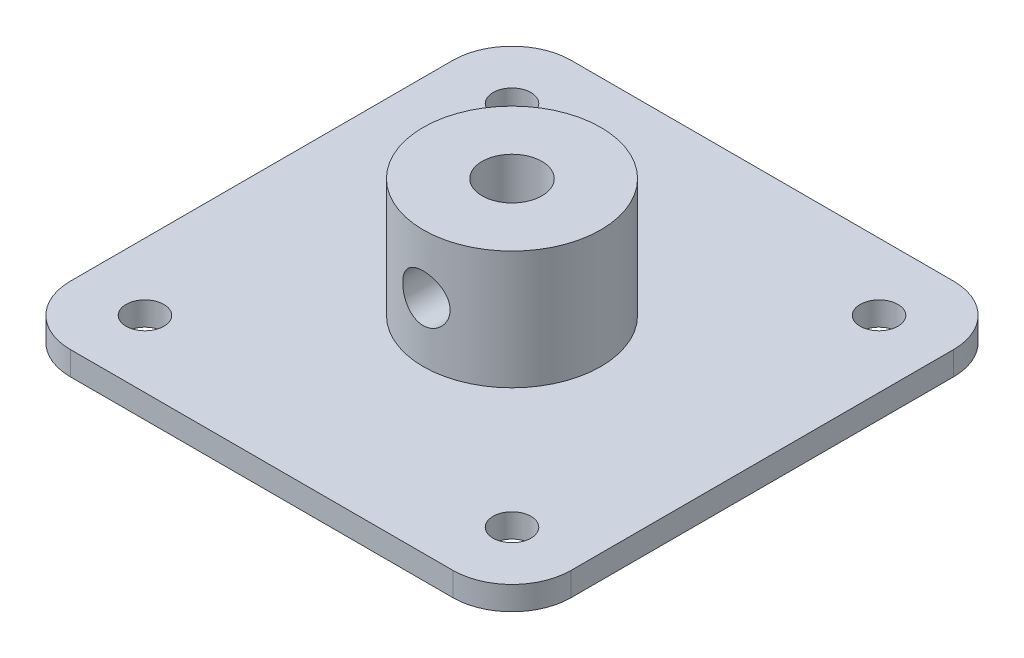
ISO-10303-21;
HEADER;
FILE_DESCRIPTION(('STEP AP214'),'2;1');
FILE_NAME('part.step','',(''),(''),'','','');
FILE_SCHEMA(('AUTOMOTIVE_DESIGN { 1 0 10303 214 1 1 1 1 }'));
ENDSEC;
DATA;
#1=APPLICATION_CONTEXT('core data for automotive mechanical design processes');
#2=APPLICATION_PROTOCOL_DEFINITION('international standard','automotive_design',2000,#1);
#3=PRODUCT_CONTEXT('',#1,'mechanical');
#4=PRODUCT('Part','Part','',(#3));
#5=PRODUCT_RELATED_PRODUCT_CATEGORY('part','',(#4));
#6=PRODUCT_DEFINITION_FORMATION('','',#4);
#7=PRODUCT_DEFINITION_CONTEXT('part definition',#1,'design');
#8=PRODUCT_DEFINITION('design','',#6,#7);
#9=PRODUCT_DEFINITION_SHAPE('','',#8);
#10=(LENGTH_UNIT() NAMED_UNIT(*) SI_UNIT(.MILLI.,.METRE.));
#11=(NAMED_UNIT(*) PLANE_ANGLE_UNIT() SI_UNIT($,.RADIAN.));
#12=(NAMED_UNIT(*) SI_UNIT($,.STERADIAN.) SOLID_ANGLE_UNIT());
#13=UNCERTAINTY_MEASURE_WITH_UNIT(LENGTH_MEASURE(1.E-05),#10,'distance_accuracy_value','');
#14=(GEOMETRIC_REPRESENTATION_CONTEXT(3) GLOBAL_UNCERTAINTY_ASSIGNED_CONTEXT((#13)) GLOBAL_UNIT_ASSIGNED_CONTEXT((#10,
#11,#12)) REPRESENTATION_CONTEXT('',''));
#15=CARTESIAN_POINT('',(0.,0.,0.));
#16=DIRECTION('',(0.,0.,1.));
#17=DIRECTION('',(1.,0.,0.));
#18=AXIS2_PLACEMENT_3D('',#15,#16,#17);
#19=CARTESIAN_POINT('',(21.15,2.,-21.15));
#20=DIRECTION('',(-1.,0.,0.));
#21=DIRECTION('',(0.,0.,1.));
#22=AXIS2_PLACEMENT_3D('',#19,#20,#21);
#23=PLANE('',#22);
#24=DIRECTION('',(0.,0.,-1.));
#25=VECTOR('',#24,1.);
#26=CARTESIAN_POINT('',(21.15,0.,-21.15));
#27=LINE('',#26,#25);
#28=CARTESIAN_POINT('',(21.15,0.,16.15));
#29=VERTEX_POINT('',#28);
#30=CARTESIAN_POINT('',(21.15,0.,-16.15));
#31=VERTEX_POINT('',#30);
#32=EDGE_CURVE('E136',#29,#31,#27,.T.);
#33=ORIENTED_EDGE('',*,*,#32,.T.);
#34=DIRECTION('',(0.,-1.,0.));
#35=VECTOR('',#34,1.);
#36=CARTESIAN_POINT('',(21.15,2.,-16.15));
#37=LINE('',#36,#35);
#38=CARTESIAN_POINT('',(21.15,2.,-16.15));
#39=VERTEX_POINT('',#38);
#40=EDGE_CURVE('E111',#31,#39,#37,.F.);
#41=ORIENTED_EDGE('',*,*,#40,.T.);
#42=DIRECTION('',(0.,0.,-1.));
#43=VECTOR('',#42,1.);
#44=CARTESIAN_POINT('',(21.15,2.,-21.15));
#45=LINE('',#44,#43);
#46=CARTESIAN_POINT('',(21.15,2.,16.15));
#47=VERTEX_POINT('',#46);
#48=EDGE_CURVE('E149',#47,#39,#45,.T.);
#49=ORIENTED_EDGE('',*,*,#48,.F.);
#50=DIRECTION('',(0.,-1.,0.));
#51=VECTOR('',#50,1.);
#52=CARTESIAN_POINT('',(21.15,2.,16.15));
#53=LINE('',#52,#51);
#54=EDGE_CURVE('E117',#47,#29,#53,.T.);
#55=ORIENTED_EDGE('',*,*,#54,.T.);
#56=EDGE_LOOP('',(#33,#41,#49,#55));
#57=FACE_BOUND('',#56,.T.);
#58=ADVANCED_FACE('F39',(#57),#23,.F.);
#59=CARTESIAN_POINT('',(-21.15,2.,-21.15));
#60=DIRECTION('',(0.,0.,1.));
#61=DIRECTION('',(1.,0.,0.));
#62=AXIS2_PLACEMENT_3D('',#59,#60,#61);
#63=PLANE('',#62);
#64=DIRECTION('',(-1.,0.,0.));
#65=VECTOR('',#64,1.);
#66=CARTESIAN_POINT('',(-21.15,2.,-21.15));
#67=LINE('',#66,#65);
#68=CARTESIAN_POINT('',(16.15,2.,-21.15));
#69=VERTEX_POINT('',#68);
#70=CARTESIAN_POINT('',(-16.15,2.,-21.15));
#71=VERTEX_POINT('',#70);
#72=EDGE_CURVE('E127',#69,#71,#67,.T.);
#73=ORIENTED_EDGE('',*,*,#72,.F.);
#74=DIRECTION('',(0.,-1.,0.));
#75=VECTOR('',#74,1.);
#76=CARTESIAN_POINT('',(16.15,2.,-21.15));
#77=LINE('',#76,#75);
#78=CARTESIAN_POINT('',(16.15,0.,-21.15));
#79=VERTEX_POINT('',#78);
#80=EDGE_CURVE('E110',#69,#79,#77,.T.);
#81=ORIENTED_EDGE('',*,*,#80,.T.);
#82=DIRECTION('',(-1.,0.,0.));
#83=VECTOR('',#82,1.);
#84=CARTESIAN_POINT('',(-21.15,0.,-21.15));
#85=LINE('',#84,#83);
#86=CARTESIAN_POINT('',(-16.15,0.,-21.15));
#87=VERTEX_POINT('',#86);
#88=EDGE_CURVE('E124',#79,#87,#85,.T.);
#89=ORIENTED_EDGE('',*,*,#88,.T.);
#90=DIRECTION('',(0.,-1.,0.));
#91=VECTOR('',#90,1.);
#92=CARTESIAN_POINT('',(-16.15,2.,-21.15));
#93=LINE('',#92,#91);
#94=EDGE_CURVE('E130',#87,#71,#93,.F.);
#95=ORIENTED_EDGE('',*,*,#94,.T.);
#96=EDGE_LOOP('',(#73,#81,#89,#95));
#97=FACE_BOUND('',#96,.T.);
#98=ADVANCED_FACE('F123',(#97),#63,.F.);
#99=CARTESIAN_POINT('',(-21.15,2.,-21.15));
#100=DIRECTION('',(1.,0.,0.));
#101=DIRECTION('',(0.,0.,-1.));
#102=AXIS2_PLACEMENT_3D('',#99,#100,#101);
#103=PLANE('',#102);
#104=DIRECTION('',(0.,0.,1.));
#105=VECTOR('',#104,1.);
#106=CARTESIAN_POINT('',(-21.15,0.,-21.15));
#107=LINE('',#106,#105);
#108=CARTESIAN_POINT('',(-21.15,0.,-16.15));
#109=VERTEX_POINT('',#108);
#110=CARTESIAN_POINT('',(-21.15,0.,16.15));
#111=VERTEX_POINT('',#110);
#112=EDGE_CURVE('E135',#109,#111,#107,.T.);
#113=ORIENTED_EDGE('',*,*,#112,.T.);
#114=DIRECTION('',(0.,-1.,0.));
#115=VECTOR('',#114,1.);
#116=CARTESIAN_POINT('',(-21.15,2.,16.15));
#117=LINE('',#116,#115);
#118=CARTESIAN_POINT('',(-21.15,2.,16.15));
#119=VERTEX_POINT('',#118);
#120=EDGE_CURVE('E11',#111,#119,#117,.F.);
#121=ORIENTED_EDGE('',*,*,#120,.T.);
#122=DIRECTION('',(0.,0.,1.));
#123=VECTOR('',#122,1.);
#124=CARTESIAN_POINT('',(-21.15,2.,-21.15));
#125=LINE('',#124,#123);
#126=CARTESIAN_POINT('',(-21.15,2.,-16.15));
#127=VERTEX_POINT('',#126);
#128=EDGE_CURVE('E188',#127,#119,#125,.T.);
#129=ORIENTED_EDGE('',*,*,#128,.F.);
#130=DIRECTION('',(0.,-1.,0.));
#131=VECTOR('',#130,1.);
#132=CARTESIAN_POINT('',(-21.15,2.,-16.15));
#133=LINE('',#132,#131);
#134=EDGE_CURVE('E48',#127,#109,#133,.T.);
#135=ORIENTED_EDGE('',*,*,#134,.T.);
#136=EDGE_LOOP('',(#113,#121,#129,#135));
#137=FACE_BOUND('',#136,.T.);
#138=ADVANCED_FACE('F186',(#137),#103,.F.);
#139=CARTESIAN_POINT('',(-21.15,2.,21.15));
#140=DIRECTION('',(0.,0.,-1.));
#141=DIRECTION('',(-1.,0.,0.));
#142=AXIS2_PLACEMENT_3D('',#139,#140,#141);
#143=PLANE('',#142);
#144=DIRECTION('',(1.,0.,0.));
#145=VECTOR('',#144,1.);
#146=CARTESIAN_POINT('',(-21.15,0.,21.15));
#147=LINE('',#146,#145);
#148=CARTESIAN_POINT('',(-16.15,0.,21.15));
#149=VERTEX_POINT('',#148);
#150=CARTESIAN_POINT('',(16.15,0.,21.15));
#151=VERTEX_POINT('',#150);
#152=EDGE_CURVE('E141',#149,#151,#147,.T.);
#153=ORIENTED_EDGE('',*,*,#152,.T.);
#154=DIRECTION('',(0.,-1.,0.));
#155=VECTOR('',#154,1.);
#156=CARTESIAN_POINT('',(16.15,2.,21.15));
#157=LINE('',#156,#155);
#158=CARTESIAN_POINT('',(16.15,2.,21.15));
#159=VERTEX_POINT('',#158);
#160=EDGE_CURVE('E55',#151,#159,#157,.F.);
#161=ORIENTED_EDGE('',*,*,#160,.T.);
#162=DIRECTION('',(1.,0.,0.));
#163=VECTOR('',#162,1.);
#164=CARTESIAN_POINT('',(-21.15,2.,21.15));
#165=LINE('',#164,#163);
#166=CARTESIAN_POINT('',(-16.15,2.,21.15));
#167=VERTEX_POINT('',#166);
#168=EDGE_CURVE('E151',#167,#159,#165,.T.);
#169=ORIENTED_EDGE('',*,*,#168,.F.);
#170=DIRECTION('',(0.,-1.,0.));
#171=VECTOR('',#170,1.);
#172=CARTESIAN_POINT('',(-16.15,2.,21.15));
#173=LINE('',#172,#171);
#174=EDGE_CURVE('E176',#167,#149,#173,.T.);
#175=ORIENTED_EDGE('',*,*,#174,.T.);
#176=EDGE_LOOP('',(#153,#161,#169,#175));
#177=FACE_BOUND('',#176,.T.);
#178=ADVANCED_FACE('F195',(#177),#143,.F.);
#179=CARTESIAN_POINT('',(0.,2.,0.));
#180=DIRECTION('',(0.,1.,0.));
#181=DIRECTION('',(0.,0.,1.));
#182=AXIS2_PLACEMENT_3D('',#179,#180,#181);
#183=PLANE('',#182);
#184=CARTESIAN_POINT('',(0.,2.,0.));
#185=DIRECTION('',(0.,1.,0.));
#186=DIRECTION('',(0.,0.,1.));
#187=AXIS2_PLACEMENT_3D('',#184,#185,#186);
#188=CIRCLE('',#187,7.5);
#189=CARTESIAN_POINT('',(0.,2.,7.5));
#190=VERTEX_POINT('',#189);
#191=EDGE_CURVE('E238',#190,#190,#188,.T.);
#192=ORIENTED_EDGE('',*,*,#191,.F.);
#193=EDGE_LOOP('',(#192));
#194=FACE_BOUND('',#193,.T.);
#195=CARTESIAN_POINT('',(-15.5,2.,15.5));
#196=DIRECTION('',(0.,1.,0.));
#197=DIRECTION('',(0.,0.,-1.));
#198=AXIS2_PLACEMENT_3D('',#195,#196,#197);
#199=CIRCLE('',#198,1.6);
#200=CARTESIAN_POINT('',(-15.5,2.,13.9));
#201=VERTEX_POINT('',#200);
#202=EDGE_CURVE('E214',#201,#201,#199,.T.);
#203=ORIENTED_EDGE('',*,*,#202,.F.);
#204=EDGE_LOOP('',(#203));
#205=FACE_BOUND('',#204,.T.);
#206=CARTESIAN_POINT('',(15.5,2.,15.5));
#207=DIRECTION('',(0.,1.,0.));
#208=DIRECTION('',(0.,0.,1.));
#209=AXIS2_PLACEMENT_3D('',#206,#207,#208);
#210=CIRCLE('',#209,1.6);
#211=CARTESIAN_POINT('',(15.5,2.,17.1));
#212=VERTEX_POINT('',#211);
#213=EDGE_CURVE('E223',#212,#212,#210,.T.);
#214=ORIENTED_EDGE('',*,*,#213,.F.);
#215=EDGE_LOOP('',(#214));
#216=FACE_BOUND('',#215,.T.);
#217=CARTESIAN_POINT('',(15.5,2.,-15.5));
#218=DIRECTION('',(0.,1.,0.));
#219=DIRECTION('',(0.,0.,-1.));
#220=AXIS2_PLACEMENT_3D('',#217,#218,#219);
#221=CIRCLE('',#220,1.6);
#222=CARTESIAN_POINT('',(15.5,2.,-17.1));
#223=VERTEX_POINT('',#222);
#224=EDGE_CURVE('E231',#223,#223,#221,.T.);
#225=ORIENTED_EDGE('',*,*,#224,.F.);
#226=EDGE_LOOP('',(#225));
#227=FACE_BOUND('',#226,.T.);
#228=CARTESIAN_POINT('',(-15.5,2.,-15.5));
#229=DIRECTION('',(0.,1.,0.));
#230=DIRECTION('',(0.,0.,1.));
#231=AXIS2_PLACEMENT_3D('',#228,#229,#230);
#232=CIRCLE('',#231,1.6);
#233=CARTESIAN_POINT('',(-15.5,2.,-13.9));
#234=VERTEX_POINT('',#233);
#235=EDGE_CURVE('E206',#234,#234,#232,.T.);
#236=ORIENTED_EDGE('',*,*,#235,.F.);
#237=EDGE_LOOP('',(#236));
#238=FACE_BOUND('',#237,.T.);
#239=ORIENTED_EDGE('',*,*,#48,.T.);
#240=CARTESIAN_POINT('',(16.15,2.,-16.15));
#241=DIRECTION('',(0.,1.,0.));
#242=DIRECTION('',(0.,0.,1.));
#243=AXIS2_PLACEMENT_3D('',#240,#241,#242);
#244=CIRCLE('',#243,5.);
#245=EDGE_CURVE('E173',#39,#69,#244,.T.);
#246=ORIENTED_EDGE('',*,*,#245,.T.);
#247=ORIENTED_EDGE('',*,*,#72,.T.);
#248=CARTESIAN_POINT('',(-16.15,2.,-16.15));
#249=DIRECTION('',(0.,1.,0.));
#250=DIRECTION('',(0.,0.,1.));
#251=AXIS2_PLACEMENT_3D('',#248,#249,#250);
#252=CIRCLE('',#251,5.);
#253=EDGE_CURVE('E165',#71,#127,#252,.T.);
#254=ORIENTED_EDGE('',*,*,#253,.T.);
#255=ORIENTED_EDGE('',*,*,#128,.T.);
#256=CARTESIAN_POINT('',(-16.15,2.,16.15));
#257=DIRECTION('',(0.,1.,0.));
#258=DIRECTION('',(0.,0.,1.));
#259=AXIS2_PLACEMENT_3D('',#256,#257,#258);
#260=CIRCLE('',#259,5.);
#261=EDGE_CURVE('E62',#119,#167,#260,.T.);
#262=ORIENTED_EDGE('',*,*,#261,.T.);
#263=ORIENTED_EDGE('',*,*,#168,.T.);
#264=CARTESIAN_POINT('',(16.15,2.,16.15));
#265=DIRECTION('',(0.,1.,0.));
#266=DIRECTION('',(0.,0.,1.));
#267=AXIS2_PLACEMENT_3D('',#264,#265,#266);
#268=CIRCLE('',#267,5.);
#269=EDGE_CURVE('E170',#159,#47,#268,.T.);
#270=ORIENTED_EDGE('',*,*,#269,.T.);
#271=EDGE_LOOP('',(#239,#246,#247,#254,#255,#262,#263,#270));
#272=FACE_BOUND('',#271,.T.);
#273=ADVANCED_FACE('F299',(#194,#205,#216,#227,#238,#272),#183,.T.);
#274=CARTESIAN_POINT('',(0.,0.,0.));
#275=DIRECTION('',(0.,1.,0.));
#276=DIRECTION('',(0.,0.,1.));
#277=AXIS2_PLACEMENT_3D('',#274,#275,#276);
#278=PLANE('',#277);
#279=CARTESIAN_POINT('',(0.,0.,0.));
#280=DIRECTION('',(0.,1.,0.));
#281=DIRECTION('',(0.,0.,1.));
#282=AXIS2_PLACEMENT_3D('',#279,#280,#281);
#283=CIRCLE('',#282,2.525);
#284=CARTESIAN_POINT('',(0.,0.,2.525));
#285=VERTEX_POINT('',#284);
#286=EDGE_CURVE('E242',#285,#285,#283,.T.);
#287=ORIENTED_EDGE('',*,*,#286,.T.);
#288=EDGE_LOOP('',(#287));
#289=FACE_BOUND('',#288,.T.);
#290=CARTESIAN_POINT('',(-15.5,0.,15.5));
#291=DIRECTION('',(0.,1.,0.));
#292=DIRECTION('',(0.,0.,-1.));
#293=AXIS2_PLACEMENT_3D('',#290,#291,#292);
#294=CIRCLE('',#293,1.6);
#295=CARTESIAN_POINT('',(-15.5,0.,13.9));
#296=VERTEX_POINT('',#295);
#297=EDGE_CURVE('E218',#296,#296,#294,.T.);
#298=ORIENTED_EDGE('',*,*,#297,.T.);
#299=EDGE_LOOP('',(#298));
#300=FACE_BOUND('',#299,.T.);
#301=CARTESIAN_POINT('',(15.5,0.,15.5));
#302=DIRECTION('',(0.,1.,0.));
#303=DIRECTION('',(0.,0.,1.));
#304=AXIS2_PLACEMENT_3D('',#301,#302,#303);
#305=CIRCLE('',#304,1.6);
#306=CARTESIAN_POINT('',(15.5,0.,17.1));
#307=VERTEX_POINT('',#306);
#308=EDGE_CURVE('E227',#307,#307,#305,.T.);
#309=ORIENTED_EDGE('',*,*,#308,.T.);
#310=EDGE_LOOP('',(#309));
#311=FACE_BOUND('',#310,.T.);
#312=CARTESIAN_POINT('',(15.5,0.,-15.5));
#313=DIRECTION('',(0.,1.,0.));
#314=DIRECTION('',(0.,0.,-1.));
#315=AXIS2_PLACEMENT_3D('',#312,#313,#314);
#316=CIRCLE('',#315,1.6);
#317=CARTESIAN_POINT('',(15.5,0.,-17.1));
#318=VERTEX_POINT('',#317);
#319=EDGE_CURVE('E210',#318,#318,#316,.T.);
#320=ORIENTED_EDGE('',*,*,#319,.T.);
#321=EDGE_LOOP('',(#320));
#322=FACE_BOUND('',#321,.T.);
#323=CARTESIAN_POINT('',(-15.5,0.,-15.5));
#324=DIRECTION('',(0.,1.,0.));
#325=DIRECTION('',(0.,0.,1.));
#326=AXIS2_PLACEMENT_3D('',#323,#324,#325);
#327=CIRCLE('',#326,1.6);
#328=CARTESIAN_POINT('',(-15.5,0.,-13.9));
#329=VERTEX_POINT('',#328);
#330=EDGE_CURVE('E143',#329,#329,#327,.T.);
#331=ORIENTED_EDGE('',*,*,#330,.T.);
#332=EDGE_LOOP('',(#331));
#333=FACE_BOUND('',#332,.T.);
#334=ORIENTED_EDGE('',*,*,#88,.F.);
#335=CARTESIAN_POINT('',(16.15,0.,-16.15));
#336=DIRECTION('',(0.,1.,0.));
#337=DIRECTION('',(0.,0.,1.));
#338=AXIS2_PLACEMENT_3D('',#335,#336,#337);
#339=CIRCLE('',#338,5.);
#340=EDGE_CURVE('E106',#79,#31,#339,.F.);
#341=ORIENTED_EDGE('',*,*,#340,.T.);
#342=ORIENTED_EDGE('',*,*,#32,.F.);
#343=CARTESIAN_POINT('',(16.15,0.,16.15));
#344=DIRECTION('',(0.,1.,0.));
#345=DIRECTION('',(0.,0.,1.));
#346=AXIS2_PLACEMENT_3D('',#343,#344,#345);
#347=CIRCLE('',#346,5.);
#348=EDGE_CURVE('E118',#29,#151,#347,.F.);
#349=ORIENTED_EDGE('',*,*,#348,.T.);
#350=ORIENTED_EDGE('',*,*,#152,.F.);
#351=CARTESIAN_POINT('',(-16.15,0.,16.15));
#352=DIRECTION('',(0.,1.,0.));
#353=DIRECTION('',(0.,0.,1.));
#354=AXIS2_PLACEMENT_3D('',#351,#352,#353);
#355=CIRCLE('',#354,5.);
#356=EDGE_CURVE('E155',#149,#111,#355,.F.);
#357=ORIENTED_EDGE('',*,*,#356,.T.);
#358=ORIENTED_EDGE('',*,*,#112,.F.);
#359=CARTESIAN_POINT('',(-16.15,0.,-16.15));
#360=DIRECTION('',(0.,1.,0.));
#361=DIRECTION('',(0.,0.,1.));
#362=AXIS2_PLACEMENT_3D('',#359,#360,#361);
#363=CIRCLE('',#362,5.);
#364=EDGE_CURVE('E129',#109,#87,#363,.F.);
#365=ORIENTED_EDGE('',*,*,#364,.T.);
#366=EDGE_LOOP('',(#334,#341,#342,#349,#350,#357,#358,#365));
#367=FACE_BOUND('',#366,.T.);
#368=ADVANCED_FACE('F132',(#289,#300,#311,#322,#333,#367),#278,.F.);
#369=CARTESIAN_POINT('',(-15.5,0.,-15.5));
#370=DIRECTION('',(0.,1.,0.));
#371=DIRECTION('',(0.,0.,1.));
#372=AXIS2_PLACEMENT_3D('',#369,#370,#371);
#373=CYLINDRICAL_SURFACE('',#372,1.6);
#374=ORIENTED_EDGE('',*,*,#330,.F.);
#375=EDGE_LOOP('',(#374));
#376=FACE_BOUND('',#375,.T.);
#377=ORIENTED_EDGE('',*,*,#235,.T.);
#378=EDGE_LOOP('',(#377));
#379=FACE_BOUND('',#378,.T.);
#380=ADVANCED_FACE('F288',(#376,#379),#373,.F.);
#381=CARTESIAN_POINT('',(15.5,0.,-15.5));
#382=DIRECTION('',(0.,1.,0.));
#383=DIRECTION('',(0.,0.,1.));
#384=AXIS2_PLACEMENT_3D('',#381,#382,#383);
#385=CYLINDRICAL_SURFACE('',#384,1.6);
#386=ORIENTED_EDGE('',*,*,#319,.F.);
#387=EDGE_LOOP('',(#386));
#388=FACE_BOUND('',#387,.T.);
#389=ORIENTED_EDGE('',*,*,#224,.T.);
#390=EDGE_LOOP('',(#389));
#391=FACE_BOUND('',#390,.T.);
#392=ADVANCED_FACE('F284',(#388,#391),#385,.F.);
#393=CARTESIAN_POINT('',(15.5,0.,15.5));
#394=DIRECTION('',(0.,1.,0.));
#395=DIRECTION('',(0.,0.,1.));
#396=AXIS2_PLACEMENT_3D('',#393,#394,#395);
#397=CYLINDRICAL_SURFACE('',#396,1.6);
#398=ORIENTED_EDGE('',*,*,#308,.F.);
#399=EDGE_LOOP('',(#398));
#400=FACE_BOUND('',#399,.T.);
#401=ORIENTED_EDGE('',*,*,#213,.T.);
#402=EDGE_LOOP('',(#401));
#403=FACE_BOUND('',#402,.T.);
#404=ADVANCED_FACE('F287',(#400,#403),#397,.F.);
#405=CARTESIAN_POINT('',(-15.5,0.,15.5));
#406=DIRECTION('',(0.,1.,0.));
#407=DIRECTION('',(0.,0.,1.));
#408=AXIS2_PLACEMENT_3D('',#405,#406,#407);
#409=CYLINDRICAL_SURFACE('',#408,1.6);
#410=ORIENTED_EDGE('',*,*,#297,.F.);
#411=EDGE_LOOP('',(#410));
#412=FACE_BOUND('',#411,.T.);
#413=ORIENTED_EDGE('',*,*,#202,.T.);
#414=EDGE_LOOP('',(#413));
#415=FACE_BOUND('',#414,.T.);
#416=ADVANCED_FACE('F282',(#412,#415),#409,.F.);
#417=CARTESIAN_POINT('',(0.,12.,0.));
#418=DIRECTION('',(0.,-1.,0.));
#419=DIRECTION('',(0.,0.,-1.));
#420=AXIS2_PLACEMENT_3D('',#417,#418,#419);
#421=CYLINDRICAL_SURFACE('',#420,7.5);
#422=CARTESIAN_POINT('',(2.,7.,7.22841614740048));
#423=CARTESIAN_POINT('',(1.99999734315871,7.11017593774028,7.22841805697252));
#424=CARTESIAN_POINT('',(1.99086493224743,7.22038000047602,7.23096264549673));
#425=CARTESIAN_POINT('',(1.95464583260237,7.43760542155637,7.24083561155097));
#426=CARTESIAN_POINT('',(1.92755013620953,7.54462515497806,7.24816638907934));
#427=CARTESIAN_POINT('',(1.85635845560073,7.75230806994678,7.26672375176839));
#428=CARTESIAN_POINT('',(1.81228637542178,7.85297995882843,7.27794485684204));
#429=CARTESIAN_POINT('',(1.70846784563703,8.04551674005983,7.30301154920402));
#430=CARTESIAN_POINT('',(1.64872017841449,8.13738094750699,7.31685734034424));
#431=CARTESIAN_POINT('',(1.51364847874559,8.31199254698772,7.34600139553467));
#432=CARTESIAN_POINT('',(1.43800297504208,8.39448701746446,7.36132541116443));
#433=CARTESIAN_POINT('',(1.27397427284021,8.5457815769512,7.39147701436507));
#434=CARTESIAN_POINT('',(1.18558975534664,8.61458024614179,7.40630455033439));
#435=CARTESIAN_POINT('',(0.99683817087327,8.73758493840293,7.43407988468418));
#436=CARTESIAN_POINT('',(0.89630181987948,8.79153951863285,7.44699376262293));
#437=CARTESIAN_POINT('',(0.687183044729091,8.88168463536726,7.46919126211834));
#438=CARTESIAN_POINT('',(0.578601980875103,8.91787816728156,7.47847549576262));
#439=CARTESIAN_POINT('',(0.35911596181009,8.97065522023577,7.49218553576461));
#440=CARTESIAN_POINT('',(0.248321224200916,8.98766897662592,7.49671776750265));
#441=CARTESIAN_POINT('',(0.0253635535085755,9.00295712010718,7.50078524617749));
#442=CARTESIAN_POINT('',(-0.0867991474385297,9.00123464363014,7.50032132946608));
#443=CARTESIAN_POINT('',(-0.306314237111346,8.97940218746053,7.49452675859765));
#444=CARTESIAN_POINT('',(-0.41371660072111,8.95975704236371,7.48931914026999));
#445=CARTESIAN_POINT('',(-0.623641315571055,8.90338786221805,7.4747674859047));
#446=CARTESIAN_POINT('',(-0.726163388180581,8.86666285331395,7.46542321400589));
#447=CARTESIAN_POINT('',(-0.924603945147554,8.77682015240762,7.44346569099892));
#448=CARTESIAN_POINT('',(-1.02044668632954,8.7235431928993,7.43082087877672));
#449=CARTESIAN_POINT('',(-1.20198999876452,8.6022311804909,7.40362468509504));
#450=CARTESIAN_POINT('',(-1.28768858808586,8.53419325097182,7.38907293223));
#451=CARTESIAN_POINT('',(-1.44928536946561,8.38282314206609,7.35911272938719));
#452=CARTESIAN_POINT('',(-1.52480192017774,8.29908555495064,7.34369169368738));
#453=CARTESIAN_POINT('',(-1.6608133210477,8.11997532376118,7.31413405023521));
#454=CARTESIAN_POINT('',(-1.72130725529808,8.02460197079955,7.29999752083065));
#455=CARTESIAN_POINT('',(-1.82584679186274,7.82409989817869,7.27455902280777));
#456=CARTESIAN_POINT('',(-1.86978866600526,7.71891464908684,7.26327507092156));
#457=CARTESIAN_POINT('',(-1.93924001685674,7.50227350054503,7.24504325087515));
#458=CARTESIAN_POINT('',(-1.96475406461341,7.39081916354967,7.23809430746845));
#459=CARTESIAN_POINT('',(-1.99596757092855,7.16837278897164,7.22954835612976));
#460=CARTESIAN_POINT('',(-2.00223632621177,7.05746645137869,7.22779763213457));
#461=CARTESIAN_POINT('',(-1.9963498112297,6.83619022719145,7.22942578390815));
#462=CARTESIAN_POINT('',(-1.98419650172323,6.72582028476005,7.23280411376438));
#463=CARTESIAN_POINT('',(-1.94231271869971,6.51094340590845,7.24416124318865));
#464=CARTESIAN_POINT('',(-1.91292447912922,6.40636456206277,7.25205039699299));
#465=CARTESIAN_POINT('',(-1.83778986725474,6.20362036864007,7.27145268952784));
#466=CARTESIAN_POINT('',(-1.79204135876651,6.10545585857257,7.28296630148563));
#467=CARTESIAN_POINT('',(-1.68432905508707,5.91594504256479,7.30863572472984));
#468=CARTESIAN_POINT('',(-1.62203095237924,5.82479602411027,7.32284404872864));
#469=CARTESIAN_POINT('',(-1.48340227987515,5.65403669829684,7.35217841933666));
#470=CARTESIAN_POINT('',(-1.40706907222966,5.57442856504585,7.36730463810238));
#471=CARTESIAN_POINT('',(-1.23990378250484,5.42664752675008,7.39729964884456));
#472=CARTESIAN_POINT('',(-1.14871641600885,5.35887162302142,7.41214836523849));
#473=CARTESIAN_POINT('',(-0.955928435940742,5.23958901258948,7.43946670017127));
#474=CARTESIAN_POINT('',(-0.854328377018883,5.18808143992108,7.45193644532905));
#475=CARTESIAN_POINT('',(-0.644314134825872,5.10327036763849,7.47301150899261));
#476=CARTESIAN_POINT('',(-0.535957852882338,5.06983098055653,7.48164558480385));
#477=CARTESIAN_POINT('',(-0.314899384731321,5.02171127193564,7.49420303787247));
#478=CARTESIAN_POINT('',(-0.202198167320244,5.00702679322532,7.4981274590498));
#479=CARTESIAN_POINT('',(0.0206420013461487,4.99709417625856,7.50077413437691));
#480=CARTESIAN_POINT('',(0.130753511527863,5.00126368086883,7.49965226288082));
#481=CARTESIAN_POINT('',(0.348648304630717,5.02756849357521,7.4926849097886));
#482=CARTESIAN_POINT('',(0.456431674812814,5.04970312711705,7.48683960554786));
#483=CARTESIAN_POINT('',(0.66591012346421,5.1109806049186,7.47111310390923));
#484=CARTESIAN_POINT('',(0.76764201185154,5.15000529347244,7.46125997189229));
#485=CARTESIAN_POINT('',(0.963172098471353,5.24384960174624,7.43854816516494));
#486=CARTESIAN_POINT('',(1.05696918166215,5.29867143661281,7.42568906899253));
#487=CARTESIAN_POINT('',(1.23667826867367,5.42425827213702,7.39791331224121));
#488=CARTESIAN_POINT('',(1.32231336173331,5.49540938069866,7.38295093371635));
#489=CARTESIAN_POINT('',(1.48062537156133,5.65090274936491,7.35284000077256));
#490=CARTESIAN_POINT('',(1.55329887243048,5.73524847581935,7.33769139839721));
#491=CARTESIAN_POINT('',(1.68520700232562,5.9169683958176,7.30853959638856));
#492=CARTESIAN_POINT('',(1.74411094261233,6.01458831365721,7.29456891224646));
#493=CARTESIAN_POINT('',(1.84458689030054,6.21870631086024,7.26981393903472));
#494=CARTESIAN_POINT('',(1.88617023367332,6.32519852853948,7.25902756724947));
#495=CARTESIAN_POINT('',(1.94538124252481,6.52608133605125,7.24336000653874));
#496=CARTESIAN_POINT('',(1.96581518399489,6.61960126455672,7.23780140272195));
#497=CARTESIAN_POINT('',(1.9931249429388,6.80874055799397,7.2303288521157));
#498=CARTESIAN_POINT('',(2.0000023063216,6.90435968228881,7.22841448976016));
#499=CARTESIAN_POINT('',(2.,7.,7.22841614740048));
#500=B_SPLINE_CURVE_WITH_KNOTS('',3,(#422,#423,#424,#425,#426,#427,#428,#429,#430,#431,#432,
#433,#434,#435,#436,#437,#438,#439,#440,#441,#442,#443,#444,#445,#446,#447,#448,#449,#450,#451,
#452,#453,#454,#455,#456,#457,#458,#459,#460,#461,#462,#463,#464,#465,#466,#467,#468,#469,#470,
#471,#472,#473,#474,#475,#476,#477,#478,#479,#480,#481,#482,#483,#484,#485,#486,#487,#488,#489,
#490,#491,#492,#493,#494,#495,#496,#497,#498,#499),.UNSPECIFIED.,.T.,.F.,(4,2,2,2,2,2,2,2,2,2,2,
2,2,2,2,2,2,2,2,2,2,2,2,2,2,2,2,2,2,2,2,2,2,2,2,2,2,2,4),(0.,0.330176128116026,
0.660517947850201,0.990396311596169,1.32030030656105,1.65765916130211,1.99505297124461,
2.33785207370803,2.68059334304246,3.0154830431648,3.35031668385603,3.67670570800803,
4.00311334440695,4.3327644890557,4.66247993394491,5.00231762300329,5.34217602639579,
5.68413015096536,6.02599942418508,6.35765334242023,6.68927196343503,7.01451850432574,
7.33980752864823,7.67224634967772,8.00474771541474,8.34685906959633,8.68895221008103,
9.028435395914,9.36784331959005,9.69684054916462,10.0258254261296,10.3525451486866,
10.6793107076596,11.0147885399158,11.3503546538105,11.6933003898558,12.0360213210131,
12.3226696767153,12.6092853429065),.UNSPECIFIED.);
#501=CARTESIAN_POINT('',(2.,7.,7.22841614740048));
#502=VERTEX_POINT('',#501);
#503=EDGE_CURVE('E250',#502,#502,#500,.T.);
#504=ORIENTED_EDGE('',*,*,#503,.F.);
#505=EDGE_LOOP('',(#504));
#506=FACE_BOUND('',#505,.T.);
#507=CARTESIAN_POINT('',(0.,12.,0.));
#508=DIRECTION('',(0.,1.,0.));
#509=DIRECTION('',(0.,0.,1.));
#510=AXIS2_PLACEMENT_3D('',#507,#508,#509);
#511=CIRCLE('',#510,7.5);
#512=CARTESIAN_POINT('',(0.,12.,7.5));
#513=VERTEX_POINT('',#512);
#514=EDGE_CURVE('E219',#513,#513,#511,.T.);
#515=ORIENTED_EDGE('',*,*,#514,.F.);
#516=EDGE_LOOP('',(#515));
#517=FACE_BOUND('',#516,.T.);
#518=ORIENTED_EDGE('',*,*,#191,.T.);
#519=EDGE_LOOP('',(#518));
#520=FACE_BOUND('',#519,.T.);
#521=ADVANCED_FACE('F278',(#506,#517,#520),#421,.T.);
#522=CARTESIAN_POINT('',(0.,12.,0.));
#523=DIRECTION('',(0.,1.,0.));
#524=DIRECTION('',(0.,0.,1.));
#525=AXIS2_PLACEMENT_3D('',#522,#523,#524);
#526=PLANE('',#525);
#527=CARTESIAN_POINT('',(0.,12.,0.));
#528=DIRECTION('',(0.,1.,0.));
#529=DIRECTION('',(0.,0.,1.));
#530=AXIS2_PLACEMENT_3D('',#527,#528,#529);
#531=CIRCLE('',#530,2.525);
#532=CARTESIAN_POINT('',(0.,12.,2.525));
#533=VERTEX_POINT('',#532);
#534=EDGE_CURVE('E246',#533,#533,#531,.T.);
#535=ORIENTED_EDGE('',*,*,#534,.F.);
#536=EDGE_LOOP('',(#535));
#537=FACE_BOUND('',#536,.T.);
#538=ORIENTED_EDGE('',*,*,#514,.T.);
#539=EDGE_LOOP('',(#538));
#540=FACE_BOUND('',#539,.T.);
#541=ADVANCED_FACE('F274',(#537,#540),#526,.T.);
#542=CARTESIAN_POINT('',(0.,0.,0.));
#543=DIRECTION('',(0.,1.,0.));
#544=DIRECTION('',(0.,0.,1.));
#545=AXIS2_PLACEMENT_3D('',#542,#543,#544);
#546=CYLINDRICAL_SURFACE('',#545,2.525);
#547=CARTESIAN_POINT('',(2.,7.,1.54130626417984));
#548=CARTESIAN_POINT('',(2.00000317478852,6.92381301140877,1.54129889289935));
#549=CARTESIAN_POINT('',(1.99560881027239,6.84764065614834,1.54705302146927));
#550=CARTESIAN_POINT('',(1.97846742854705,6.69769668206914,1.56890878907999));
#551=CARTESIAN_POINT('',(1.96570220531862,6.62393066479991,1.58503298079249));
#552=CARTESIAN_POINT('',(1.92710662339401,6.45591917801637,1.63189193090131));
#553=CARTESIAN_POINT('',(1.89830778589067,6.36325156747414,1.66573198115219));
#554=CARTESIAN_POINT('',(1.82922507719416,6.18571466927005,1.74131935345498));
#555=CARTESIAN_POINT('',(1.78890758455166,6.10086918662662,1.78308970148616));
#556=CARTESIAN_POINT('',(1.6821388550536,5.91094871943806,1.88498869899315));
#557=CARTESIAN_POINT('',(1.61146938520318,5.8089730332497,1.94648477363496));
#558=CARTESIAN_POINT('',(1.45220699437782,5.61927909816718,2.06803723974961));
#559=CARTESIAN_POINT('',(1.36362888842967,5.53154917185188,2.12809477562756));
#560=CARTESIAN_POINT('',(1.1878267096983,5.38775675246354,2.23000634879869));
#561=CARTESIAN_POINT('',(1.10367293256742,5.32885252718822,2.27313165482082));
#562=CARTESIAN_POINT('',(0.924631714084026,5.22354245444415,2.3516364875072));
#563=CARTESIAN_POINT('',(0.8297611318899,5.17711735382898,2.38702793022871));
#564=CARTESIAN_POINT('',(0.646739501143734,5.10532505718287,2.44233197000764));
#565=CARTESIAN_POINT('',(0.559920496163954,5.07778278390706,2.46381133709417));
#566=CARTESIAN_POINT('',(0.38163911590209,5.0346131319654,2.49763658839044));
#567=CARTESIAN_POINT('',(0.290179267866218,5.01897934106259,2.50998738785879));
#568=CARTESIAN_POINT('',(0.104846578862318,5.00057411986345,2.52453887057928));
#569=CARTESIAN_POINT('',(0.0109667899837609,4.99784516975851,2.52670603115285));
#570=CARTESIAN_POINT('',(-0.175904797642351,5.00555684522321,2.52059973073326));
#571=CARTESIAN_POINT('',(-0.268896538522949,5.01599832318316,2.51232559397913));
#572=CARTESIAN_POINT('',(-0.446422857028333,5.04847886495483,2.4867582529663));
#573=CARTESIAN_POINT('',(-0.531146128904647,5.06989059565377,2.46995331716056));
#574=CARTESIAN_POINT('',(-0.695420680761349,5.12280932881192,2.42882549652588));
#575=CARTESIAN_POINT('',(-0.774970672240586,5.15431883481239,2.40450074736265));
#576=CARTESIAN_POINT('',(-0.935225614309432,5.22970294250884,2.34710874615225));
#577=CARTESIAN_POINT('',(-1.01527357156992,5.2744893442661,2.31341665029539));
#578=CARTESIAN_POINT('',(-1.16688946237917,5.37317348485261,2.24077532061343));
#579=CARTESIAN_POINT('',(-1.23845223598291,5.42707671989193,2.20182291841145));
#580=CARTESIAN_POINT('',(-1.3865469927922,5.55469316135635,2.11235549514404));
#581=CARTESIAN_POINT('',(-1.46108672754716,5.63020179754603,2.06110774743181));
#582=CARTESIAN_POINT('',(-1.59718512048189,5.7916257213492,1.9575329792418));
#583=CARTESIAN_POINT('',(-1.65872918073348,5.87755254292375,1.90520481678606));
#584=CARTESIAN_POINT('',(-1.76186016543743,6.04887050539829,1.80991903408609));
#585=CARTESIAN_POINT('',(-1.80493906386817,6.13314994792387,1.76658110499705));
#586=CARTESIAN_POINT('',(-1.87955915643418,6.30977811789666,1.68696387131072));
#587=CARTESIAN_POINT('',(-1.91112568491175,6.40210856606086,1.65066915072983));
#588=CARTESIAN_POINT('',(-1.95387797995322,6.56709142904491,1.59961642405609));
#589=CARTESIAN_POINT('',(-1.96830549321608,6.63789019914126,1.58166951379016));
#590=CARTESIAN_POINT('',(-1.98944540749103,6.78227543149995,1.55500193322927));
#591=CARTESIAN_POINT('',(-1.99617395542132,6.8558557238362,1.54626195644663));
#592=CARTESIAN_POINT('',(-2.00137682346259,7.00418775155028,1.53952608451401));
#593=CARTESIAN_POINT('',(-1.99981109398124,7.0789434298179,1.54158231932555));
#594=CARTESIAN_POINT('',(-1.98848485726517,7.22682684534581,1.55615804660381));
#595=CARTESIAN_POINT('',(-1.97871223978666,7.29995201280428,1.56869300154954));
#596=CARTESIAN_POINT('',(-1.94801681011135,7.46241471520758,1.60673241817709));
#597=CARTESIAN_POINT('',(-1.92476585787718,7.55067685532522,1.63485647514801));
#598=CARTESIAN_POINT('',(-1.867865861402,7.7205213516915,1.6995767059675));
#599=CARTESIAN_POINT('',(-1.83418651101317,7.80208335085592,1.73619749352755));
#600=CARTESIAN_POINT('',(-1.74121976762073,7.99175284490502,1.83024153250884));
#601=CARTESIAN_POINT('',(-1.67713264574749,8.09640499249639,1.88988998305205));
#602=CARTESIAN_POINT('',(-1.53136821430703,8.29221851406587,2.00985646809369));
#603=CARTESIAN_POINT('',(-1.44967239649368,8.38336552157125,2.07017514329597));
#604=CARTESIAN_POINT('',(-1.26791093476352,8.55172241122086,2.18626012766138));
#605=CARTESIAN_POINT('',(-1.16766424373143,8.62877859241228,2.24197297278575));
#606=CARTESIAN_POINT('',(-1.00499336296678,8.73033732677895,2.31715106186275));
#607=CARTESIAN_POINT('',(-0.948770647041221,8.76183258485293,2.34079595975809));
#608=CARTESIAN_POINT('',(-0.832478518308719,8.81966869431026,2.38463009677325));
#609=CARTESIAN_POINT('',(-0.77241133892908,8.84601250297416,2.4048213176983));
#610=CARTESIAN_POINT('',(-0.627118081077583,8.90123296416258,2.44742763651519));
#611=CARTESIAN_POINT('',(-0.540462423362046,8.92775225645717,2.46813513398132));
#612=CARTESIAN_POINT('',(-0.362773927164141,8.96893404188004,2.50043247737561));
#613=CARTESIAN_POINT('',(-0.271744431463428,8.98360544192841,2.51202917237662));
#614=CARTESIAN_POINT('',(-0.0874969403063761,9.00023010692016,2.52517696544923));
#615=CARTESIAN_POINT('',(0.00572699943720737,9.00214353039641,2.52669659409995));
#616=CARTESIAN_POINT('',(0.191134396672803,8.99300923159818,2.51946487694757));
#617=CARTESIAN_POINT('',(0.283317710338857,8.98195973932364,2.51071212851955));
#618=CARTESIAN_POINT('',(0.45987412293386,8.94839412115929,2.48430349606139));
#619=CARTESIAN_POINT('',(0.544412315251133,8.92640731108267,2.46705893326437));
#620=CARTESIAN_POINT('',(0.708231126508918,8.87239308007573,2.42511690292539));
#621=CARTESIAN_POINT('',(0.787510406247684,8.84036311341995,2.40041754581195));
#622=CARTESIAN_POINT('',(0.94743451232798,8.76380688213511,2.34221199706521));
#623=CARTESIAN_POINT('',(1.02738975112045,8.71833760825955,2.30806345270942));
#624=CARTESIAN_POINT('',(1.17872701852194,8.61828475787361,2.23457331621269));
#625=CARTESIAN_POINT('',(1.25010344594912,8.56369528168913,2.19522836609556));
#626=CARTESIAN_POINT('',(1.39780209662018,8.4344604097667,2.10492934630481));
#627=CARTESIAN_POINT('',(1.47209645832321,8.35800184697025,2.05325679546943));
#628=CARTESIAN_POINT('',(1.60753884098496,8.19461376388492,1.94903584846874));
#629=CARTESIAN_POINT('',(1.66867439293031,8.10767443285094,1.8964866719826));
#630=CARTESIAN_POINT('',(1.76987914243831,7.93598822827504,1.80201980426968));
#631=CARTESIAN_POINT('',(1.81167749455661,7.85252701192299,1.75962409890049));
#632=CARTESIAN_POINT('',(1.88403404633436,7.67773972403067,1.68191861154209));
#633=CARTESIAN_POINT('',(1.91461010162235,7.58642643409615,1.64659761413285));
#634=CARTESIAN_POINT('',(1.95851543200126,7.41317617132319,1.59399415823379));
#635=CARTESIAN_POINT('',(1.97393760459828,7.33243369646496,1.57462705810807));
#636=CARTESIAN_POINT('',(1.99466233376339,7.16778107547707,1.54830655728858));
#637=CARTESIAN_POINT('',(1.99999650456642,7.08388166851297,1.54131437993973));
#638=CARTESIAN_POINT('',(2.,7.,1.54130626417984));
#639=B_SPLINE_CURVE_WITH_KNOTS('',3,(#547,#548,#549,#550,#551,#552,#553,#554,#555,#556,#557,
#558,#559,#560,#561,#562,#563,#564,#565,#566,#567,#568,#569,#570,#571,#572,#573,#574,#575,#576,
#577,#578,#579,#580,#581,#582,#583,#584,#585,#586,#587,#588,#589,#590,#591,#592,#593,#594,#595,
#596,#597,#598,#599,#600,#601,#602,#603,#604,#605,#606,#607,#608,#609,#610,#611,#612,#613,#614,
#615,#616,#617,#618,#619,#620,#621,#622,#623,#624,#625,#626,#627,#628,#629,#630,#631,#632,#633,
#634,#635,#636,#637,#638),.UNSPECIFIED.,.T.,.F.,(4,2,2,2,2,2,2,2,2,2,2,2,2,2,2,2,2,2,2,2,2,2,2,
2,2,2,2,2,2,2,2,2,2,2,2,2,2,2,2,2,2,2,2,2,2,4),(0.,0.228227527357189,0.456953086976423,
0.763549413244423,1.07104996082069,1.48447542687956,1.89756027343416,2.23051601339228,
2.56295507236225,2.84250760524556,3.12190950375954,3.40223050097981,3.68256964151059,
3.94841902989234,4.2143343813677,4.50642302290975,4.79868838595137,5.15091023312368,
5.50352564774282,5.81491893164811,6.12562276258562,6.34813222598359,6.57017416347336,
6.79328922283061,7.01673409480657,7.30166077627914,7.58742338538664,7.99466880625878,
8.40234438267481,8.81423135733826,9.01983843684451,9.22532713521449,9.50295272819799,
9.78036941507833,10.0586520333232,10.3369726536342,10.6029712868876,10.869037399688,
11.1623149518842,11.4557829592122,11.809918062112,12.1643872729468,12.4710503097382,
12.7772232823934,13.0292924363148,13.2805703270584),.UNSPECIFIED.);
#640=CARTESIAN_POINT('',(2.,7.,1.54130626417984));
#641=VERTEX_POINT('',#640);
#642=EDGE_CURVE('E262',#641,#641,#639,.T.);
#643=ORIENTED_EDGE('',*,*,#642,.F.);
#644=EDGE_LOOP('',(#643));
#645=FACE_BOUND('',#644,.T.);
#646=ORIENTED_EDGE('',*,*,#286,.F.);
#647=EDGE_LOOP('',(#646));
#648=FACE_BOUND('',#647,.T.);
#649=ORIENTED_EDGE('',*,*,#534,.T.);
#650=EDGE_LOOP('',(#649));
#651=FACE_BOUND('',#650,.T.);
#652=ADVANCED_FACE('F271',(#645,#648,#651),#546,.F.);
#653=CARTESIAN_POINT('',(16.15,2.,-16.15));
#654=DIRECTION('',(0.,-1.,0.));
#655=DIRECTION('',(0.,0.,-1.));
#656=AXIS2_PLACEMENT_3D('',#653,#654,#655);
#657=CYLINDRICAL_SURFACE('',#656,5.);
#658=ORIENTED_EDGE('',*,*,#245,.F.);
#659=ORIENTED_EDGE('',*,*,#40,.F.);
#660=ORIENTED_EDGE('',*,*,#340,.F.);
#661=ORIENTED_EDGE('',*,*,#80,.F.);
#662=EDGE_LOOP('',(#658,#659,#660,#661));
#663=FACE_BOUND('',#662,.T.);
#664=ADVANCED_FACE('F109',(#663),#657,.T.);
#665=CARTESIAN_POINT('',(16.15,2.,16.15));
#666=DIRECTION('',(0.,-1.,0.));
#667=DIRECTION('',(0.,0.,-1.));
#668=AXIS2_PLACEMENT_3D('',#665,#666,#667);
#669=CYLINDRICAL_SURFACE('',#668,5.);
#670=ORIENTED_EDGE('',*,*,#269,.F.);
#671=ORIENTED_EDGE('',*,*,#160,.F.);
#672=ORIENTED_EDGE('',*,*,#348,.F.);
#673=ORIENTED_EDGE('',*,*,#54,.F.);
#674=EDGE_LOOP('',(#670,#671,#672,#673));
#675=FACE_BOUND('',#674,.T.);
#676=ADVANCED_FACE('F317',(#675),#669,.T.);
#677=CARTESIAN_POINT('',(-16.15,2.,16.15));
#678=DIRECTION('',(0.,-1.,0.));
#679=DIRECTION('',(0.,0.,-1.));
#680=AXIS2_PLACEMENT_3D('',#677,#678,#679);
#681=CYLINDRICAL_SURFACE('',#680,5.);
#682=ORIENTED_EDGE('',*,*,#261,.F.);
#683=ORIENTED_EDGE('',*,*,#120,.F.);
#684=ORIENTED_EDGE('',*,*,#356,.F.);
#685=ORIENTED_EDGE('',*,*,#174,.F.);
#686=EDGE_LOOP('',(#682,#683,#684,#685));
#687=FACE_BOUND('',#686,.T.);
#688=ADVANCED_FACE('F194',(#687),#681,.T.);
#689=CARTESIAN_POINT('',(-16.15,2.,-16.15));
#690=DIRECTION('',(0.,-1.,0.));
#691=DIRECTION('',(0.,0.,-1.));
#692=AXIS2_PLACEMENT_3D('',#689,#690,#691);
#693=CYLINDRICAL_SURFACE('',#692,5.);
#694=ORIENTED_EDGE('',*,*,#253,.F.);
#695=ORIENTED_EDGE('',*,*,#94,.F.);
#696=ORIENTED_EDGE('',*,*,#364,.F.);
#697=ORIENTED_EDGE('',*,*,#134,.F.);
#698=EDGE_LOOP('',(#694,#695,#696,#697));
#699=FACE_BOUND('',#698,.T.);
#700=ADVANCED_FACE('F41',(#699),#693,.T.);
#701=CARTESIAN_POINT('',(0.,7.,-21.151));
#702=DIRECTION('',(0.,0.,1.));
#703=DIRECTION('',(1.,0.,0.));
#704=AXIS2_PLACEMENT_3D('',#701,#702,#703);
#705=CYLINDRICAL_SURFACE('',#704,2.);
#706=ORIENTED_EDGE('',*,*,#642,.T.);
#707=EDGE_LOOP('',(#706));
#708=FACE_BOUND('',#707,.T.);
#709=ORIENTED_EDGE('',*,*,#503,.T.);
#710=EDGE_LOOP('',(#709));
#711=FACE_BOUND('',#710,.T.);
#712=ADVANCED_FACE('F267',(#708,#711),#705,.F.);
#713=CLOSED_SHELL('',(#58,#98,#138,#178,#273,#368,#380,#392,#404,#416,#521,#541,#652,#664,#676,
#688,#700,#712));
#714=MANIFOLD_SOLID_BREP('B2',#713);
#715=ADVANCED_BREP_SHAPE_REPRESENTATION('',(#18,#714),#14);
#716=SHAPE_DEFINITION_REPRESENTATION(#9,#715);
ENDSEC;
END-ISO-10303-21;
